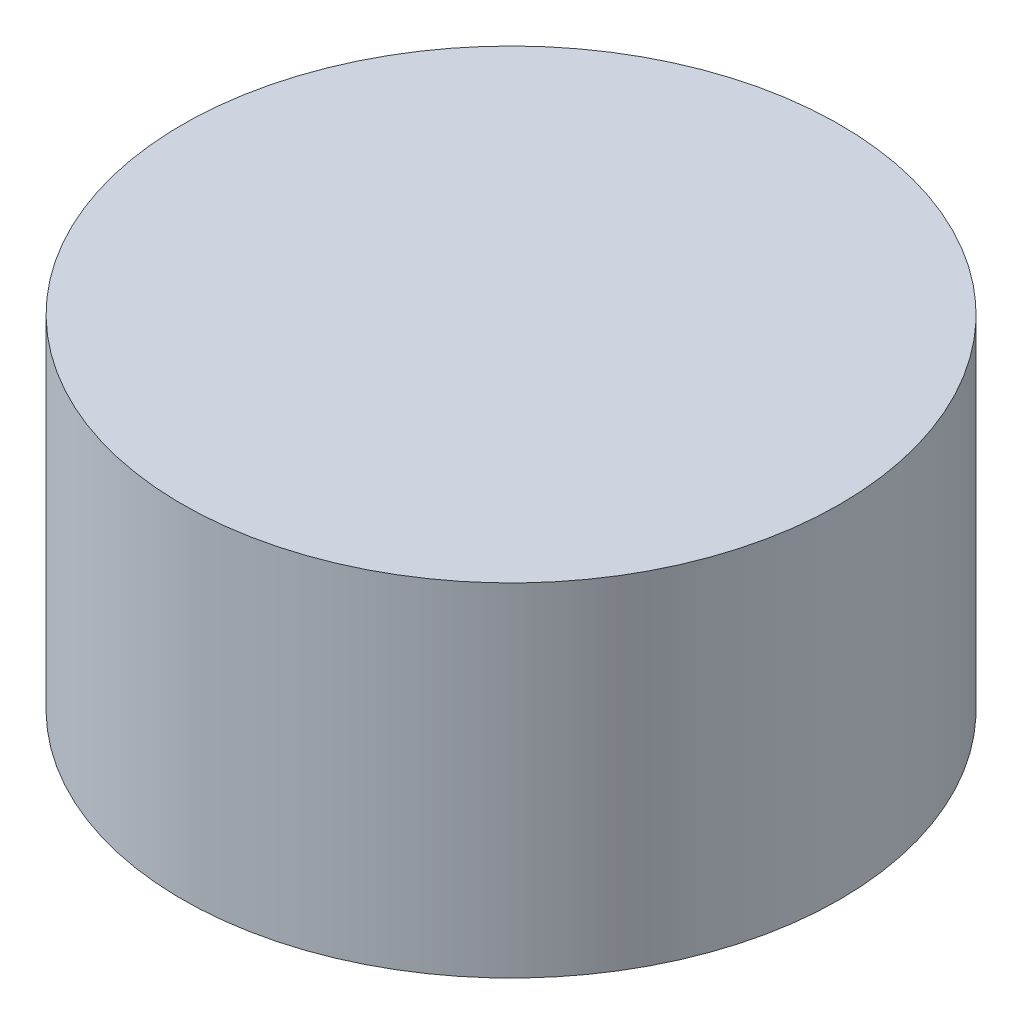
ISO-10303-21;
HEADER;
FILE_DESCRIPTION(('STEP AP214'),'2;1');
FILE_NAME('part.step','',(''),(''),'','','');
FILE_SCHEMA(('AUTOMOTIVE_DESIGN { 1 0 10303 214 1 1 1 1 }'));
ENDSEC;
DATA;
#1=APPLICATION_CONTEXT('core data for automotive mechanical design processes');
#2=APPLICATION_PROTOCOL_DEFINITION('international standard','automotive_design',2000,#1);
#3=PRODUCT_CONTEXT('',#1,'mechanical');
#4=PRODUCT('Part','Part','',(#3));
#5=PRODUCT_RELATED_PRODUCT_CATEGORY('part','',(#4));
#6=PRODUCT_DEFINITION_FORMATION('','',#4);
#7=PRODUCT_DEFINITION_CONTEXT('part definition',#1,'design');
#8=PRODUCT_DEFINITION('design','',#6,#7);
#9=PRODUCT_DEFINITION_SHAPE('','',#8);
#10=(LENGTH_UNIT() NAMED_UNIT(*) SI_UNIT(.MILLI.,.METRE.));
#11=(NAMED_UNIT(*) PLANE_ANGLE_UNIT() SI_UNIT($,.RADIAN.));
#12=(NAMED_UNIT(*) SI_UNIT($,.STERADIAN.) SOLID_ANGLE_UNIT());
#13=UNCERTAINTY_MEASURE_WITH_UNIT(LENGTH_MEASURE(1.E-05),#10,'distance_accuracy_value','');
#14=(GEOMETRIC_REPRESENTATION_CONTEXT(3) GLOBAL_UNCERTAINTY_ASSIGNED_CONTEXT((#13)) GLOBAL_UNIT_ASSIGNED_CONTEXT((#10,
#11,#12)) REPRESENTATION_CONTEXT('',''));
#15=CARTESIAN_POINT('',(0.,0.,0.));
#16=DIRECTION('',(0.,0.,1.));
#17=DIRECTION('',(1.,0.,0.));
#18=AXIS2_PLACEMENT_3D('',#15,#16,#17);
#19=CARTESIAN_POINT('',(-7.51121883032134E-12,-24.6750506500045,1019.9001013));
#20=DIRECTION('',(0.,1.,0.));
#21=DIRECTION('',(0.,0.,1.));
#22=AXIS2_PLACEMENT_3D('',#19,#20,#21);
#23=PLANE('',#22);
#24=CARTESIAN_POINT('',(-7.51121883032134E-12,-24.6750506500045,1019.9001013));
#25=DIRECTION('',(0.,1.,0.));
#26=DIRECTION('',(-1.,0.,0.));
#27=AXIS2_PLACEMENT_3D('',#24,#25,#26);
#28=CIRCLE('',#27,30.75);
#29=CARTESIAN_POINT('',(30.7499999999925,-24.6750506500045,1019.9001013));
#30=VERTEX_POINT('',#29);
#31=EDGE_CURVE('E11',#30,#30,#28,.T.);
#32=ORIENTED_EDGE('',*,*,#31,.F.);
#33=EDGE_LOOP('',(#32));
#34=FACE_BOUND('',#33,.T.);
#35=ADVANCED_FACE('F17',(#34),#23,.F.);
#36=CARTESIAN_POINT('',(-7.51299518716074E-12,7.32494934999556,1019.9001013));
#37=DIRECTION('',(0.,1.,0.));
#38=DIRECTION('',(0.,0.,1.));
#39=AXIS2_PLACEMENT_3D('',#36,#37,#38);
#40=PLANE('',#39);
#41=CARTESIAN_POINT('',(-7.51299518716074E-12,7.32494934999556,1019.9001013));
#42=DIRECTION('',(0.,1.,0.));
#43=DIRECTION('',(-1.,0.,0.));
#44=AXIS2_PLACEMENT_3D('',#41,#42,#43);
#45=CIRCLE('',#44,30.75);
#46=CARTESIAN_POINT('',(30.7499999999925,7.32494934999556,1019.9001013));
#47=VERTEX_POINT('',#46);
#48=EDGE_CURVE('E27',#47,#47,#45,.T.);
#49=ORIENTED_EDGE('',*,*,#48,.T.);
#50=EDGE_LOOP('',(#49));
#51=FACE_BOUND('',#50,.T.);
#52=ADVANCED_FACE('F19',(#51),#40,.T.);
#53=CARTESIAN_POINT('',(-7.51299518716074E-12,7.32494934999556,1019.9001013));
#54=DIRECTION('',(0.,-1.,0.));
#55=DIRECTION('',(1.,0.,0.));
#56=AXIS2_PLACEMENT_3D('',#53,#54,#55);
#57=CYLINDRICAL_SURFACE('',#56,30.75);
#58=ORIENTED_EDGE('',*,*,#31,.T.);
#59=EDGE_LOOP('',(#58));
#60=FACE_BOUND('',#59,.T.);
#61=ORIENTED_EDGE('',*,*,#48,.F.);
#62=EDGE_LOOP('',(#61));
#63=FACE_BOUND('',#62,.T.);
#64=ADVANCED_FACE('F55',(#60,#63),#57,.T.);
#65=CLOSED_SHELL('',(#35,#52,#64));
#66=MANIFOLD_SOLID_BREP('B1',#65);
#67=ADVANCED_BREP_SHAPE_REPRESENTATION('',(#18,#66),#14);
#68=SHAPE_DEFINITION_REPRESENTATION(#9,#67);
ENDSEC;
END-ISO-10303-21;
